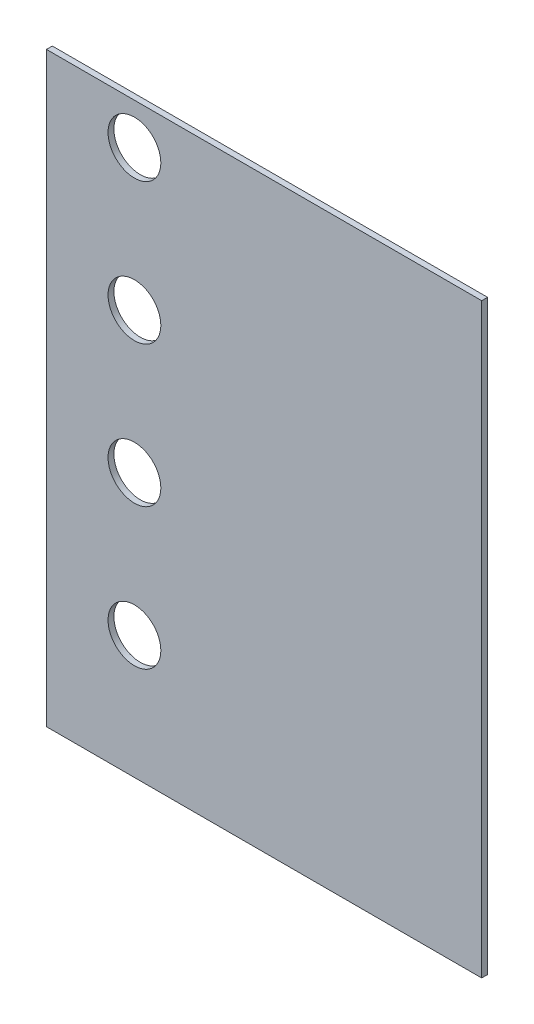
ISO-10303-21;
HEADER;
FILE_DESCRIPTION(('STEP AP214'),'2;1');
FILE_NAME('part.step','',(''),(''),'','','');
FILE_SCHEMA(('AUTOMOTIVE_DESIGN { 1 0 10303 214 1 1 1 1 }'));
ENDSEC;
DATA;
#1=APPLICATION_CONTEXT('core data for automotive mechanical design processes');
#2=APPLICATION_PROTOCOL_DEFINITION('international standard','automotive_design',2000,#1);
#3=PRODUCT_CONTEXT('',#1,'mechanical');
#4=PRODUCT('Part','Part','',(#3));
#5=PRODUCT_RELATED_PRODUCT_CATEGORY('part','',(#4));
#6=PRODUCT_DEFINITION_FORMATION('','',#4);
#7=PRODUCT_DEFINITION_CONTEXT('part definition',#1,'design');
#8=PRODUCT_DEFINITION('design','',#6,#7);
#9=PRODUCT_DEFINITION_SHAPE('','',#8);
#10=(LENGTH_UNIT() NAMED_UNIT(*) SI_UNIT(.MILLI.,.METRE.));
#11=(NAMED_UNIT(*) PLANE_ANGLE_UNIT() SI_UNIT($,.RADIAN.));
#12=(NAMED_UNIT(*) SI_UNIT($,.STERADIAN.) SOLID_ANGLE_UNIT());
#13=UNCERTAINTY_MEASURE_WITH_UNIT(LENGTH_MEASURE(1.E-05),#10,'distance_accuracy_value','');
#14=(GEOMETRIC_REPRESENTATION_CONTEXT(3) GLOBAL_UNCERTAINTY_ASSIGNED_CONTEXT((#13)) GLOBAL_UNIT_ASSIGNED_CONTEXT((#10,
#11,#12)) REPRESENTATION_CONTEXT('',''));
#15=CARTESIAN_POINT('',(0.,0.,0.));
#16=DIRECTION('',(0.,0.,1.));
#17=DIRECTION('',(1.,0.,0.));
#18=AXIS2_PLACEMENT_3D('',#15,#16,#17);
#19=CARTESIAN_POINT('',(-85.09,-73.66,0.));
#20=DIRECTION('',(0.,0.,1.));
#21=DIRECTION('',(1.,0.,0.));
#22=AXIS2_PLACEMENT_3D('',#19,#20,#21);
#23=CYLINDRICAL_SURFACE('',#22,11.43);
#24=CARTESIAN_POINT('',(-85.09,-73.66,0.));
#25=DIRECTION('',(0.,0.,1.));
#26=DIRECTION('',(1.,0.,0.));
#27=AXIS2_PLACEMENT_3D('',#24,#25,#26);
#28=CIRCLE('',#27,11.43);
#29=CARTESIAN_POINT('',(-73.66,-73.66,0.));
#30=VERTEX_POINT('',#29);
#31=EDGE_CURVE('E40',#30,#30,#28,.T.);
#32=ORIENTED_EDGE('',*,*,#31,.F.);
#33=EDGE_LOOP('',(#32));
#34=FACE_BOUND('',#33,.T.);
#35=CARTESIAN_POINT('',(-85.09,-73.66,2.54));
#36=DIRECTION('',(0.,0.,1.));
#37=DIRECTION('',(1.,0.,0.));
#38=AXIS2_PLACEMENT_3D('',#35,#36,#37);
#39=CIRCLE('',#38,11.43);
#40=CARTESIAN_POINT('',(-73.66,-73.66,2.54));
#41=VERTEX_POINT('',#40);
#42=EDGE_CURVE('E11',#41,#41,#39,.T.);
#43=ORIENTED_EDGE('',*,*,#42,.T.);
#44=EDGE_LOOP('',(#43));
#45=FACE_BOUND('',#44,.T.);
#46=ADVANCED_FACE('F33',(#34,#45),#23,.F.);
#47=CARTESIAN_POINT('',(-85.09,-12.7,0.));
#48=DIRECTION('',(0.,0.,1.));
#49=DIRECTION('',(1.,0.,0.));
#50=AXIS2_PLACEMENT_3D('',#47,#48,#49);
#51=CYLINDRICAL_SURFACE('',#50,11.43);
#52=CARTESIAN_POINT('',(-85.09,-12.7,0.));
#53=DIRECTION('',(0.,0.,1.));
#54=DIRECTION('',(1.,0.,0.));
#55=AXIS2_PLACEMENT_3D('',#52,#53,#54);
#56=CIRCLE('',#55,11.43);
#57=CARTESIAN_POINT('',(-73.66,-12.7,0.));
#58=VERTEX_POINT('',#57);
#59=EDGE_CURVE('E74',#58,#58,#56,.T.);
#60=ORIENTED_EDGE('',*,*,#59,.F.);
#61=EDGE_LOOP('',(#60));
#62=FACE_BOUND('',#61,.T.);
#63=CARTESIAN_POINT('',(-85.09,-12.7,2.54));
#64=DIRECTION('',(0.,0.,1.));
#65=DIRECTION('',(1.,0.,0.));
#66=AXIS2_PLACEMENT_3D('',#63,#64,#65);
#67=CIRCLE('',#66,11.43);
#68=CARTESIAN_POINT('',(-73.66,-12.7,2.54));
#69=VERTEX_POINT('',#68);
#70=EDGE_CURVE('E101',#69,#69,#67,.T.);
#71=ORIENTED_EDGE('',*,*,#70,.T.);
#72=EDGE_LOOP('',(#71));
#73=FACE_BOUND('',#72,.T.);
#74=ADVANCED_FACE('F109',(#62,#73),#51,.F.);
#75=CARTESIAN_POINT('',(-123.19,-127.,2.54));
#76=DIRECTION('',(-1.,0.,0.));
#77=DIRECTION('',(0.,0.,1.));
#78=AXIS2_PLACEMENT_3D('',#75,#76,#77);
#79=PLANE('',#78);
#80=DIRECTION('',(0.,1.,0.));
#81=VECTOR('',#80,1.);
#82=CARTESIAN_POINT('',(-123.19,-127.,0.));
#83=LINE('',#82,#81);
#84=CARTESIAN_POINT('',(-123.19,-127.,0.));
#85=VERTEX_POINT('',#84);
#86=CARTESIAN_POINT('',(-123.19,127.,0.));
#87=VERTEX_POINT('',#86);
#88=EDGE_CURVE('E82',#85,#87,#83,.T.);
#89=ORIENTED_EDGE('',*,*,#88,.F.);
#90=DIRECTION('',(0.,0.,-1.));
#91=VECTOR('',#90,1.);
#92=CARTESIAN_POINT('',(-123.19,-127.,2.54));
#93=LINE('',#92,#91);
#94=CARTESIAN_POINT('',(-123.19,-127.,2.54));
#95=VERTEX_POINT('',#94);
#96=EDGE_CURVE('E56',#95,#85,#93,.T.);
#97=ORIENTED_EDGE('',*,*,#96,.F.);
#98=DIRECTION('',(0.,1.,0.));
#99=VECTOR('',#98,1.);
#100=CARTESIAN_POINT('',(-123.19,-127.,2.54));
#101=LINE('',#100,#99);
#102=CARTESIAN_POINT('',(-123.19,127.,2.54));
#103=VERTEX_POINT('',#102);
#104=EDGE_CURVE('E84',#95,#103,#101,.T.);
#105=ORIENTED_EDGE('',*,*,#104,.T.);
#106=DIRECTION('',(0.,0.,-1.));
#107=VECTOR('',#106,1.);
#108=CARTESIAN_POINT('',(-123.19,127.,2.54));
#109=LINE('',#108,#107);
#110=EDGE_CURVE('E75',#103,#87,#109,.T.);
#111=ORIENTED_EDGE('',*,*,#110,.T.);
#112=EDGE_LOOP('',(#89,#97,#105,#111));
#113=FACE_BOUND('',#112,.T.);
#114=ADVANCED_FACE('F87',(#113),#79,.T.);
#115=CARTESIAN_POINT('',(-123.19,-127.,2.54));
#116=DIRECTION('',(0.,1.,0.));
#117=DIRECTION('',(0.,0.,1.));
#118=AXIS2_PLACEMENT_3D('',#115,#116,#117);
#119=PLANE('',#118);
#120=DIRECTION('',(1.,0.,0.));
#121=VECTOR('',#120,1.);
#122=CARTESIAN_POINT('',(-123.19,-127.,0.));
#123=LINE('',#122,#121);
#124=CARTESIAN_POINT('',(65.278,-127.,0.));
#125=VERTEX_POINT('',#124);
#126=EDGE_CURVE('E70',#85,#125,#123,.T.);
#127=ORIENTED_EDGE('',*,*,#126,.T.);
#128=DIRECTION('',(0.,0.,1.));
#129=VECTOR('',#128,1.);
#130=CARTESIAN_POINT('',(65.278,-127.,0.));
#131=LINE('',#130,#129);
#132=CARTESIAN_POINT('',(65.278,-127.,2.54));
#133=VERTEX_POINT('',#132);
#134=EDGE_CURVE('E47',#125,#133,#131,.T.);
#135=ORIENTED_EDGE('',*,*,#134,.T.);
#136=DIRECTION('',(1.,0.,0.));
#137=VECTOR('',#136,1.);
#138=CARTESIAN_POINT('',(-123.19,-127.,2.54));
#139=LINE('',#138,#137);
#140=EDGE_CURVE('E72',#95,#133,#139,.T.);
#141=ORIENTED_EDGE('',*,*,#140,.F.);
#142=ORIENTED_EDGE('',*,*,#96,.T.);
#143=EDGE_LOOP('',(#127,#135,#141,#142));
#144=FACE_BOUND('',#143,.T.);
#145=ADVANCED_FACE('F69',(#144),#119,.F.);
#146=CARTESIAN_POINT('',(-123.19,127.,2.54));
#147=DIRECTION('',(0.,1.,0.));
#148=DIRECTION('',(0.,0.,1.));
#149=AXIS2_PLACEMENT_3D('',#146,#147,#148);
#150=PLANE('',#149);
#151=DIRECTION('',(0.,0.,1.));
#152=VECTOR('',#151,1.);
#153=CARTESIAN_POINT('',(65.278,127.,0.));
#154=LINE('',#153,#152);
#155=CARTESIAN_POINT('',(65.278,127.,0.));
#156=VERTEX_POINT('',#155);
#157=CARTESIAN_POINT('',(65.278,127.,2.54));
#158=VERTEX_POINT('',#157);
#159=EDGE_CURVE('E224',#156,#158,#154,.T.);
#160=ORIENTED_EDGE('',*,*,#159,.F.);
#161=DIRECTION('',(1.,0.,0.));
#162=VECTOR('',#161,1.);
#163=CARTESIAN_POINT('',(-123.19,127.,0.));
#164=LINE('',#163,#162);
#165=EDGE_CURVE('E85',#87,#156,#164,.T.);
#166=ORIENTED_EDGE('',*,*,#165,.F.);
#167=ORIENTED_EDGE('',*,*,#110,.F.);
#168=DIRECTION('',(1.,0.,0.));
#169=VECTOR('',#168,1.);
#170=CARTESIAN_POINT('',(-123.19,127.,2.54));
#171=LINE('',#170,#169);
#172=EDGE_CURVE('E212',#103,#158,#171,.T.);
#173=ORIENTED_EDGE('',*,*,#172,.T.);
#174=EDGE_LOOP('',(#160,#166,#167,#173));
#175=FACE_BOUND('',#174,.T.);
#176=ADVANCED_FACE('F114',(#175),#150,.T.);
#177=CARTESIAN_POINT('',(0.,0.,2.54));
#178=DIRECTION('',(0.,0.,-1.));
#179=DIRECTION('',(-1.,0.,0.));
#180=AXIS2_PLACEMENT_3D('',#177,#178,#179);
#181=PLANE('',#180);
#182=CARTESIAN_POINT('',(-85.09,48.26,2.54));
#183=DIRECTION('',(0.,0.,1.));
#184=DIRECTION('',(1.,0.,0.));
#185=AXIS2_PLACEMENT_3D('',#182,#183,#184);
#186=CIRCLE('',#185,11.43);
#187=CARTESIAN_POINT('',(-73.66,48.26,2.54));
#188=VERTEX_POINT('',#187);
#189=EDGE_CURVE('E206',#188,#188,#186,.T.);
#190=ORIENTED_EDGE('',*,*,#189,.F.);
#191=EDGE_LOOP('',(#190));
#192=FACE_BOUND('',#191,.T.);
#193=CARTESIAN_POINT('',(-85.09,109.22,2.54));
#194=DIRECTION('',(0.,0.,1.));
#195=DIRECTION('',(1.,0.,0.));
#196=AXIS2_PLACEMENT_3D('',#193,#194,#195);
#197=CIRCLE('',#196,11.43);
#198=CARTESIAN_POINT('',(-73.66,109.22,2.54));
#199=VERTEX_POINT('',#198);
#200=EDGE_CURVE('E93',#199,#199,#197,.T.);
#201=ORIENTED_EDGE('',*,*,#200,.F.);
#202=EDGE_LOOP('',(#201));
#203=FACE_BOUND('',#202,.T.);
#204=ORIENTED_EDGE('',*,*,#140,.T.);
#205=DIRECTION('',(0.,-1.,0.));
#206=VECTOR('',#205,1.);
#207=CARTESIAN_POINT('',(65.278,127.,2.54));
#208=LINE('',#207,#206);
#209=EDGE_CURVE('E220',#158,#133,#208,.T.);
#210=ORIENTED_EDGE('',*,*,#209,.F.);
#211=ORIENTED_EDGE('',*,*,#172,.F.);
#212=ORIENTED_EDGE('',*,*,#104,.F.);
#213=EDGE_LOOP('',(#204,#210,#211,#212));
#214=FACE_BOUND('',#213,.T.);
#215=ORIENTED_EDGE('',*,*,#70,.F.);
#216=EDGE_LOOP('',(#215));
#217=FACE_BOUND('',#216,.T.);
#218=ORIENTED_EDGE('',*,*,#42,.F.);
#219=EDGE_LOOP('',(#218));
#220=FACE_BOUND('',#219,.T.);
#221=ADVANCED_FACE('F112',(#192,#203,#214,#217,#220),#181,.F.);
#222=CARTESIAN_POINT('',(0.,0.,0.));
#223=DIRECTION('',(0.,0.,-1.));
#224=DIRECTION('',(-1.,0.,0.));
#225=AXIS2_PLACEMENT_3D('',#222,#223,#224);
#226=PLANE('',#225);
#227=DIRECTION('',(0.,-1.,0.));
#228=VECTOR('',#227,1.);
#229=CARTESIAN_POINT('',(65.278,127.,0.));
#230=LINE('',#229,#228);
#231=EDGE_CURVE('E83',#156,#125,#230,.T.);
#232=ORIENTED_EDGE('',*,*,#231,.T.);
#233=ORIENTED_EDGE('',*,*,#126,.F.);
#234=ORIENTED_EDGE('',*,*,#88,.T.);
#235=ORIENTED_EDGE('',*,*,#165,.T.);
#236=EDGE_LOOP('',(#232,#233,#234,#235));
#237=FACE_BOUND('',#236,.T.);
#238=CARTESIAN_POINT('',(-85.09,48.26,0.));
#239=DIRECTION('',(0.,0.,1.));
#240=DIRECTION('',(1.,0.,0.));
#241=AXIS2_PLACEMENT_3D('',#238,#239,#240);
#242=CIRCLE('',#241,11.43);
#243=CARTESIAN_POINT('',(-73.66,48.26,0.));
#244=VERTEX_POINT('',#243);
#245=EDGE_CURVE('E209',#244,#244,#242,.T.);
#246=ORIENTED_EDGE('',*,*,#245,.T.);
#247=EDGE_LOOP('',(#246));
#248=FACE_BOUND('',#247,.T.);
#249=CARTESIAN_POINT('',(-85.09,109.22,0.));
#250=DIRECTION('',(0.,0.,1.));
#251=DIRECTION('',(1.,0.,0.));
#252=AXIS2_PLACEMENT_3D('',#249,#250,#251);
#253=CIRCLE('',#252,11.43);
#254=CARTESIAN_POINT('',(-73.66,109.22,0.));
#255=VERTEX_POINT('',#254);
#256=EDGE_CURVE('E89',#255,#255,#253,.T.);
#257=ORIENTED_EDGE('',*,*,#256,.T.);
#258=EDGE_LOOP('',(#257));
#259=FACE_BOUND('',#258,.T.);
#260=ORIENTED_EDGE('',*,*,#59,.T.);
#261=EDGE_LOOP('',(#260));
#262=FACE_BOUND('',#261,.T.);
#263=ORIENTED_EDGE('',*,*,#31,.T.);
#264=EDGE_LOOP('',(#263));
#265=FACE_BOUND('',#264,.T.);
#266=ADVANCED_FACE('F79',(#237,#248,#259,#262,#265),#226,.T.);
#267=CARTESIAN_POINT('',(-85.09,109.22,0.));
#268=DIRECTION('',(0.,0.,1.));
#269=DIRECTION('',(1.,0.,0.));
#270=AXIS2_PLACEMENT_3D('',#267,#268,#269);
#271=CYLINDRICAL_SURFACE('',#270,11.43);
#272=ORIENTED_EDGE('',*,*,#256,.F.);
#273=EDGE_LOOP('',(#272));
#274=FACE_BOUND('',#273,.T.);
#275=ORIENTED_EDGE('',*,*,#200,.T.);
#276=EDGE_LOOP('',(#275));
#277=FACE_BOUND('',#276,.T.);
#278=ADVANCED_FACE('F121',(#274,#277),#271,.F.);
#279=CARTESIAN_POINT('',(-85.09,48.26,0.));
#280=DIRECTION('',(0.,0.,1.));
#281=DIRECTION('',(1.,0.,0.));
#282=AXIS2_PLACEMENT_3D('',#279,#280,#281);
#283=CYLINDRICAL_SURFACE('',#282,11.43);
#284=ORIENTED_EDGE('',*,*,#245,.F.);
#285=EDGE_LOOP('',(#284));
#286=FACE_BOUND('',#285,.T.);
#287=ORIENTED_EDGE('',*,*,#189,.T.);
#288=EDGE_LOOP('',(#287));
#289=FACE_BOUND('',#288,.T.);
#290=ADVANCED_FACE('F179',(#286,#289),#283,.F.);
#291=CARTESIAN_POINT('',(65.278,127.,0.));
#292=DIRECTION('',(-1.,0.,0.));
#293=DIRECTION('',(0.,-1.,0.));
#294=AXIS2_PLACEMENT_3D('',#291,#292,#293);
#295=PLANE('',#294);
#296=ORIENTED_EDGE('',*,*,#209,.T.);
#297=ORIENTED_EDGE('',*,*,#134,.F.);
#298=ORIENTED_EDGE('',*,*,#231,.F.);
#299=ORIENTED_EDGE('',*,*,#159,.T.);
#300=EDGE_LOOP('',(#296,#297,#298,#299));
#301=FACE_BOUND('',#300,.T.);
#302=ADVANCED_FACE('F175',(#301),#295,.F.);
#303=CLOSED_SHELL('',(#46,#74,#114,#145,#176,#221,#266,#278,#290,#302));
#304=MANIFOLD_SOLID_BREP('B2',#303);
#305=ADVANCED_BREP_SHAPE_REPRESENTATION('',(#18,#304),#14);
#306=SHAPE_DEFINITION_REPRESENTATION(#9,#305);
ENDSEC;
END-ISO-10303-21;
